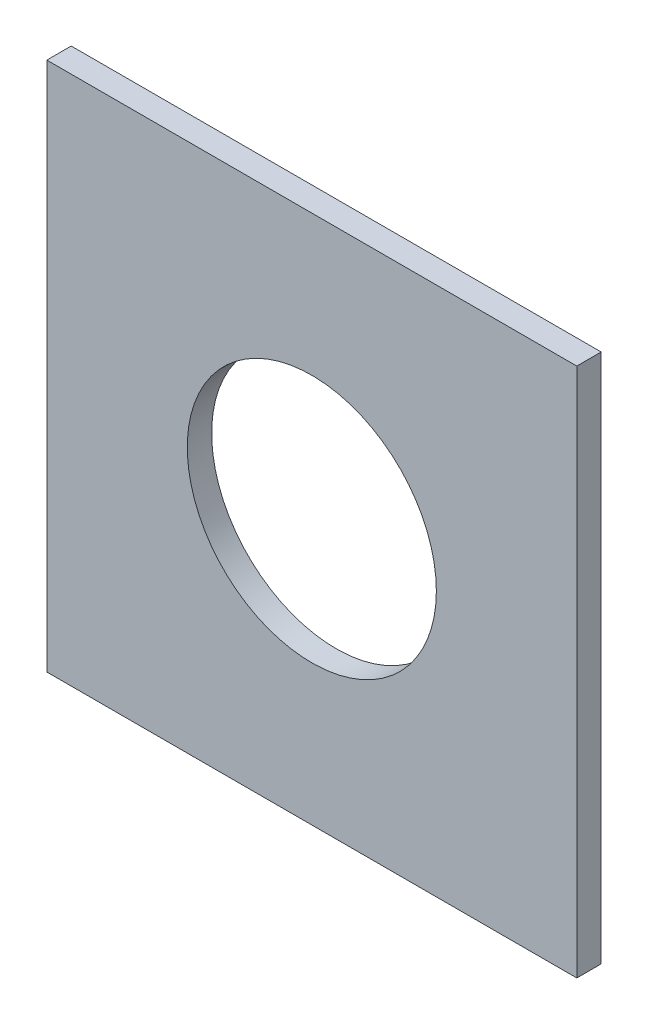
ISO-10303-21;
HEADER;
FILE_DESCRIPTION(('STEP AP214'),'2;1');
FILE_NAME('part.step','',(''),(''),'','','');
FILE_SCHEMA(('AUTOMOTIVE_DESIGN { 1 0 10303 214 1 1 1 1 }'));
ENDSEC;
DATA;
#1=APPLICATION_CONTEXT('core data for automotive mechanical design processes');
#2=APPLICATION_PROTOCOL_DEFINITION('international standard','automotive_design',2000,#1);
#3=PRODUCT_CONTEXT('',#1,'mechanical');
#4=PRODUCT('Part','Part','',(#3));
#5=PRODUCT_RELATED_PRODUCT_CATEGORY('part','',(#4));
#6=PRODUCT_DEFINITION_FORMATION('','',#4);
#7=PRODUCT_DEFINITION_CONTEXT('part definition',#1,'design');
#8=PRODUCT_DEFINITION('design','',#6,#7);
#9=PRODUCT_DEFINITION_SHAPE('','',#8);
#10=(LENGTH_UNIT() NAMED_UNIT(*) SI_UNIT(.MILLI.,.METRE.));
#11=(NAMED_UNIT(*) PLANE_ANGLE_UNIT() SI_UNIT($,.RADIAN.));
#12=(NAMED_UNIT(*) SI_UNIT($,.STERADIAN.) SOLID_ANGLE_UNIT());
#13=UNCERTAINTY_MEASURE_WITH_UNIT(LENGTH_MEASURE(1.E-05),#10,'distance_accuracy_value','');
#14=(GEOMETRIC_REPRESENTATION_CONTEXT(3) GLOBAL_UNCERTAINTY_ASSIGNED_CONTEXT((#13)) GLOBAL_UNIT_ASSIGNED_CONTEXT((#10,
#11,#12)) REPRESENTATION_CONTEXT('',''));
#15=CARTESIAN_POINT('',(0.,0.,0.));
#16=DIRECTION('',(0.,0.,1.));
#17=DIRECTION('',(1.,0.,0.));
#18=AXIS2_PLACEMENT_3D('',#15,#16,#17);
#19=CARTESIAN_POINT('',(0.,-63.8498841251449,4.6));
#20=DIRECTION('',(0.,1.,0.));
#21=DIRECTION('',(-1.,0.,0.));
#22=AXIS2_PLACEMENT_3D('',#19,#20,#21);
#23=PLANE('',#22);
#24=DIRECTION('',(1.,0.,0.));
#25=VECTOR('',#24,1.);
#26=CARTESIAN_POINT('',(0.,-63.8498841251449,0.));
#27=LINE('',#26,#25);
#28=CARTESIAN_POINT('',(-44.1716804571744,-63.8498841251449,0.));
#29=VERTEX_POINT('',#28);
#30=CARTESIAN_POINT('',(55.8283195428256,-63.8498841251448,0.));
#31=VERTEX_POINT('',#30);
#32=EDGE_CURVE('E101',#29,#31,#27,.T.);
#33=ORIENTED_EDGE('',*,*,#32,.T.);
#34=DIRECTION('',(0.,0.,-1.));
#35=VECTOR('',#34,1.);
#36=CARTESIAN_POINT('',(55.8283195428256,-63.8498841251448,4.6));
#37=LINE('',#36,#35);
#38=CARTESIAN_POINT('',(55.8283195428256,-63.8498841251448,4.6));
#39=VERTEX_POINT('',#38);
#40=EDGE_CURVE('E11',#39,#31,#37,.T.);
#41=ORIENTED_EDGE('',*,*,#40,.F.);
#42=DIRECTION('',(1.,0.,0.));
#43=VECTOR('',#42,1.);
#44=CARTESIAN_POINT('',(0.,-63.8498841251449,4.6));
#45=LINE('',#44,#43);
#46=CARTESIAN_POINT('',(-44.1716804571744,-63.8498841251449,4.6));
#47=VERTEX_POINT('',#46);
#48=EDGE_CURVE('E74',#47,#39,#45,.T.);
#49=ORIENTED_EDGE('',*,*,#48,.F.);
#50=DIRECTION('',(0.,0.,-1.));
#51=VECTOR('',#50,1.);
#52=CARTESIAN_POINT('',(-44.1716804571744,-63.8498841251449,4.6));
#53=LINE('',#52,#51);
#54=EDGE_CURVE('E100',#47,#29,#53,.T.);
#55=ORIENTED_EDGE('',*,*,#54,.T.);
#56=EDGE_LOOP('',(#33,#41,#49,#55));
#57=FACE_BOUND('',#56,.T.);
#58=ADVANCED_FACE('F35',(#57),#23,.F.);
#59=CARTESIAN_POINT('',(55.8283195428256,0.,4.6));
#60=DIRECTION('',(1.,0.,0.));
#61=DIRECTION('',(0.,1.,0.));
#62=AXIS2_PLACEMENT_3D('',#59,#60,#61);
#63=PLANE('',#62);
#64=DIRECTION('',(0.,-1.,0.));
#65=VECTOR('',#64,1.);
#66=CARTESIAN_POINT('',(55.8283195428256,0.,0.));
#67=LINE('',#66,#65);
#68=CARTESIAN_POINT('',(55.8283195428256,36.1501158748551,0.));
#69=VERTEX_POINT('',#68);
#70=EDGE_CURVE('E83',#69,#31,#67,.T.);
#71=ORIENTED_EDGE('',*,*,#70,.F.);
#72=DIRECTION('',(0.,0.,-1.));
#73=VECTOR('',#72,1.);
#74=CARTESIAN_POINT('',(55.8283195428256,36.1501158748551,4.6));
#75=LINE('',#74,#73);
#76=CARTESIAN_POINT('',(55.8283195428256,36.1501158748551,4.6));
#77=VERTEX_POINT('',#76);
#78=EDGE_CURVE('E43',#77,#69,#75,.T.);
#79=ORIENTED_EDGE('',*,*,#78,.F.);
#80=DIRECTION('',(0.,-1.,0.));
#81=VECTOR('',#80,1.);
#82=CARTESIAN_POINT('',(55.8283195428256,0.,4.6));
#83=LINE('',#82,#81);
#84=EDGE_CURVE('E81',#77,#39,#83,.T.);
#85=ORIENTED_EDGE('',*,*,#84,.T.);
#86=ORIENTED_EDGE('',*,*,#40,.T.);
#87=EDGE_LOOP('',(#71,#79,#85,#86));
#88=FACE_BOUND('',#87,.T.);
#89=ADVANCED_FACE('F80',(#88),#63,.T.);
#90=CARTESIAN_POINT('',(0.,36.1501158748551,4.6));
#91=DIRECTION('',(0.,1.,0.));
#92=DIRECTION('',(0.,0.,1.));
#93=AXIS2_PLACEMENT_3D('',#90,#91,#92);
#94=PLANE('',#93);
#95=DIRECTION('',(1.,0.,0.));
#96=VECTOR('',#95,1.);
#97=CARTESIAN_POINT('',(0.,36.1501158748551,0.));
#98=LINE('',#97,#96);
#99=CARTESIAN_POINT('',(-44.1716804571744,36.1501158748551,0.));
#100=VERTEX_POINT('',#99);
#101=EDGE_CURVE('E105',#100,#69,#98,.T.);
#102=ORIENTED_EDGE('',*,*,#101,.F.);
#103=DIRECTION('',(0.,0.,-1.));
#104=VECTOR('',#103,1.);
#105=CARTESIAN_POINT('',(-44.1716804571744,36.1501158748551,4.6));
#106=LINE('',#105,#104);
#107=CARTESIAN_POINT('',(-44.1716804571744,36.1501158748551,4.6));
#108=VERTEX_POINT('',#107);
#109=EDGE_CURVE('E66',#108,#100,#106,.T.);
#110=ORIENTED_EDGE('',*,*,#109,.F.);
#111=DIRECTION('',(1.,0.,0.));
#112=VECTOR('',#111,1.);
#113=CARTESIAN_POINT('',(0.,36.1501158748551,4.6));
#114=LINE('',#113,#112);
#115=EDGE_CURVE('E90',#108,#77,#114,.T.);
#116=ORIENTED_EDGE('',*,*,#115,.T.);
#117=ORIENTED_EDGE('',*,*,#78,.T.);
#118=EDGE_LOOP('',(#102,#110,#116,#117));
#119=FACE_BOUND('',#118,.T.);
#120=ADVANCED_FACE('F92',(#119),#94,.T.);
#121=CARTESIAN_POINT('',(-44.1716804571744,0.,4.6));
#122=DIRECTION('',(1.,0.,0.));
#123=DIRECTION('',(0.,1.,0.));
#124=AXIS2_PLACEMENT_3D('',#121,#122,#123);
#125=PLANE('',#124);
#126=DIRECTION('',(0.,-1.,0.));
#127=VECTOR('',#126,1.);
#128=CARTESIAN_POINT('',(-44.1716804571744,0.,0.));
#129=LINE('',#128,#127);
#130=EDGE_CURVE('E69',#100,#29,#129,.T.);
#131=ORIENTED_EDGE('',*,*,#130,.T.);
#132=ORIENTED_EDGE('',*,*,#54,.F.);
#133=DIRECTION('',(0.,-1.,0.));
#134=VECTOR('',#133,1.);
#135=CARTESIAN_POINT('',(-44.1716804571744,0.,4.6));
#136=LINE('',#135,#134);
#137=EDGE_CURVE('E51',#108,#47,#136,.T.);
#138=ORIENTED_EDGE('',*,*,#137,.F.);
#139=ORIENTED_EDGE('',*,*,#109,.T.);
#140=EDGE_LOOP('',(#131,#132,#138,#139));
#141=FACE_BOUND('',#140,.T.);
#142=ADVANCED_FACE('F123',(#141),#125,.F.);
#143=CARTESIAN_POINT('',(5.8283195428256,-13.8498841251449,4.6));
#144=DIRECTION('',(0.,0.,-1.));
#145=DIRECTION('',(-1.,0.,0.));
#146=AXIS2_PLACEMENT_3D('',#143,#144,#145);
#147=CYLINDRICAL_SURFACE('',#146,23.5);
#148=CARTESIAN_POINT('',(5.8283195428256,-13.8498841251449,4.6));
#149=DIRECTION('',(0.,0.,1.));
#150=DIRECTION('',(1.,0.,0.));
#151=AXIS2_PLACEMENT_3D('',#148,#149,#150);
#152=CIRCLE('',#151,23.5);
#153=CARTESIAN_POINT('',(29.3283195428256,-13.8498841251449,4.6));
#154=VERTEX_POINT('',#153);
#155=EDGE_CURVE('E94',#154,#154,#152,.T.);
#156=ORIENTED_EDGE('',*,*,#155,.T.);
#157=EDGE_LOOP('',(#156));
#158=FACE_BOUND('',#157,.T.);
#159=CARTESIAN_POINT('',(5.8283195428256,-13.8498841251449,0.));
#160=DIRECTION('',(0.,0.,1.));
#161=DIRECTION('',(1.,0.,0.));
#162=AXIS2_PLACEMENT_3D('',#159,#160,#161);
#163=CIRCLE('',#162,23.5);
#164=CARTESIAN_POINT('',(29.3283195428256,-13.8498841251449,0.));
#165=VERTEX_POINT('',#164);
#166=EDGE_CURVE('E108',#165,#165,#163,.T.);
#167=ORIENTED_EDGE('',*,*,#166,.F.);
#168=EDGE_LOOP('',(#167));
#169=FACE_BOUND('',#168,.T.);
#170=ADVANCED_FACE('F121',(#158,#169),#147,.F.);
#171=CARTESIAN_POINT('',(0.,0.,4.6));
#172=DIRECTION('',(0.,0.,1.));
#173=DIRECTION('',(1.,0.,0.));
#174=AXIS2_PLACEMENT_3D('',#171,#172,#173);
#175=PLANE('',#174);
#176=ORIENTED_EDGE('',*,*,#48,.T.);
#177=ORIENTED_EDGE('',*,*,#84,.F.);
#178=ORIENTED_EDGE('',*,*,#115,.F.);
#179=ORIENTED_EDGE('',*,*,#137,.T.);
#180=EDGE_LOOP('',(#176,#177,#178,#179));
#181=FACE_BOUND('',#180,.T.);
#182=ORIENTED_EDGE('',*,*,#155,.F.);
#183=EDGE_LOOP('',(#182));
#184=FACE_BOUND('',#183,.T.);
#185=ADVANCED_FACE('F88',(#181,#184),#175,.T.);
#186=CARTESIAN_POINT('',(0.,0.,0.));
#187=DIRECTION('',(0.,0.,1.));
#188=DIRECTION('',(1.,0.,0.));
#189=AXIS2_PLACEMENT_3D('',#186,#187,#188);
#190=PLANE('',#189);
#191=ORIENTED_EDGE('',*,*,#32,.F.);
#192=ORIENTED_EDGE('',*,*,#130,.F.);
#193=ORIENTED_EDGE('',*,*,#101,.T.);
#194=ORIENTED_EDGE('',*,*,#70,.T.);
#195=EDGE_LOOP('',(#191,#192,#193,#194));
#196=FACE_BOUND('',#195,.T.);
#197=ORIENTED_EDGE('',*,*,#166,.T.);
#198=EDGE_LOOP('',(#197));
#199=FACE_BOUND('',#198,.T.);
#200=ADVANCED_FACE('F115',(#196,#199),#190,.F.);
#201=CLOSED_SHELL('',(#58,#89,#120,#142,#170,#185,#200));
#202=MANIFOLD_SOLID_BREP('B2',#201);
#203=ADVANCED_BREP_SHAPE_REPRESENTATION('',(#18,#202),#14);
#204=SHAPE_DEFINITION_REPRESENTATION(#9,#203);
ENDSEC;
END-ISO-10303-21;
